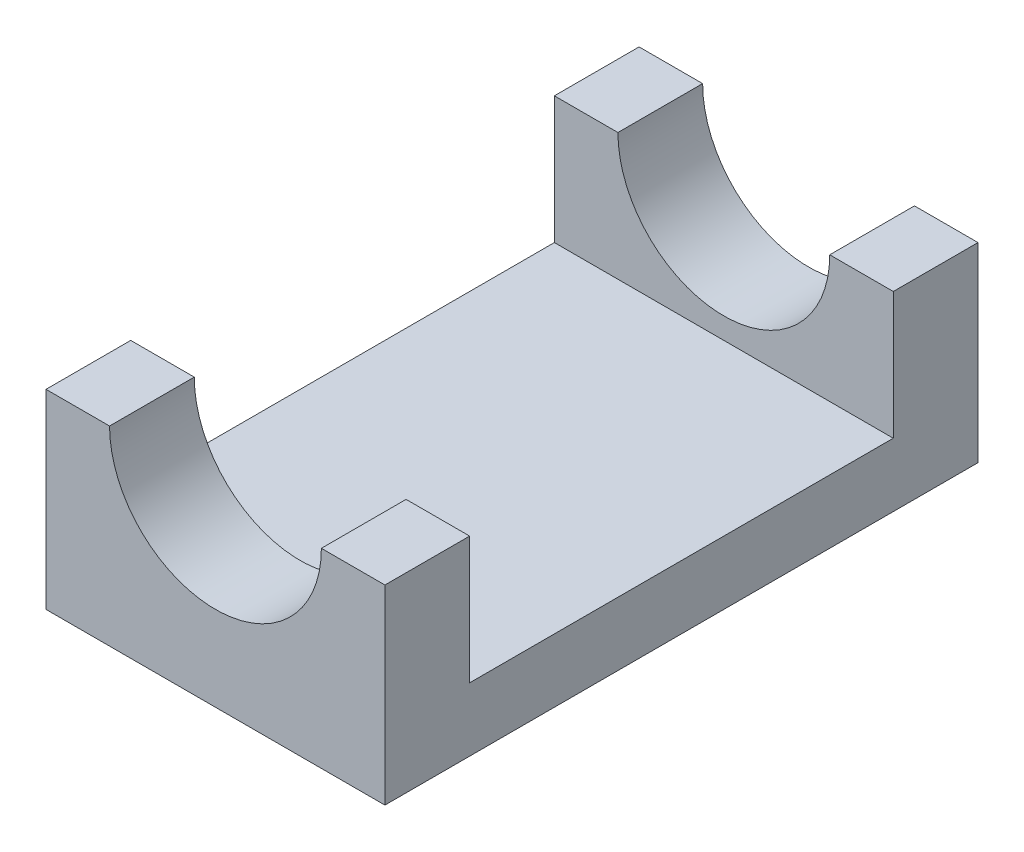
ISO-10303-21;
HEADER;
FILE_DESCRIPTION(('STEP AP214'),'2;1');
FILE_NAME('part.step','',(''),(''),'','','');
FILE_SCHEMA(('AUTOMOTIVE_DESIGN { 1 0 10303 214 1 1 1 1 }'));
ENDSEC;
DATA;
#1=APPLICATION_CONTEXT('core data for automotive mechanical design processes');
#2=APPLICATION_PROTOCOL_DEFINITION('international standard','automotive_design',2000,#1);
#3=PRODUCT_CONTEXT('',#1,'mechanical');
#4=PRODUCT('Part','Part','',(#3));
#5=PRODUCT_RELATED_PRODUCT_CATEGORY('part','',(#4));
#6=PRODUCT_DEFINITION_FORMATION('','',#4);
#7=PRODUCT_DEFINITION_CONTEXT('part definition',#1,'design');
#8=PRODUCT_DEFINITION('design','',#6,#7);
#9=PRODUCT_DEFINITION_SHAPE('','',#8);
#10=(LENGTH_UNIT() NAMED_UNIT(*) SI_UNIT(.MILLI.,.METRE.));
#11=(NAMED_UNIT(*) PLANE_ANGLE_UNIT() SI_UNIT($,.RADIAN.));
#12=(NAMED_UNIT(*) SI_UNIT($,.STERADIAN.) SOLID_ANGLE_UNIT());
#13=UNCERTAINTY_MEASURE_WITH_UNIT(LENGTH_MEASURE(1.E-05),#10,'distance_accuracy_value','');
#14=(GEOMETRIC_REPRESENTATION_CONTEXT(3) GLOBAL_UNCERTAINTY_ASSIGNED_CONTEXT((#13)) GLOBAL_UNIT_ASSIGNED_CONTEXT((#10,
#11,#12)) REPRESENTATION_CONTEXT('',''));
#15=CARTESIAN_POINT('',(0.,0.,0.));
#16=DIRECTION('',(0.,0.,1.));
#17=DIRECTION('',(1.,0.,0.));
#18=AXIS2_PLACEMENT_3D('',#15,#16,#17);
#19=CARTESIAN_POINT('',(-20.,0.,0.));
#20=DIRECTION('',(0.,-1.,0.));
#21=DIRECTION('',(1.,0.,0.));
#22=AXIS2_PLACEMENT_3D('',#19,#20,#21);
#23=PLANE('',#22);
#24=DIRECTION('',(0.,0.,1.));
#25=VECTOR('',#24,1.);
#26=CARTESIAN_POINT('',(-20.,0.,0.));
#27=LINE('',#26,#25);
#28=CARTESIAN_POINT('',(-20.,0.,0.));
#29=VERTEX_POINT('',#28);
#30=CARTESIAN_POINT('',(-20.,0.,10.));
#31=VERTEX_POINT('',#30);
#32=EDGE_CURVE('E172',#29,#31,#27,.T.);
#33=ORIENTED_EDGE('',*,*,#32,.T.);
#34=DIRECTION('',(1.,0.,0.));
#35=VECTOR('',#34,1.);
#36=CARTESIAN_POINT('',(-20.,0.,10.));
#37=LINE('',#36,#35);
#38=CARTESIAN_POINT('',(-12.5,0.,10.));
#39=VERTEX_POINT('',#38);
#40=EDGE_CURVE('E11',#31,#39,#37,.T.);
#41=ORIENTED_EDGE('',*,*,#40,.T.);
#42=DIRECTION('',(0.,0.,-1.));
#43=VECTOR('',#42,1.);
#44=CARTESIAN_POINT('',(-12.5,0.,10.));
#45=LINE('',#44,#43);
#46=CARTESIAN_POINT('',(-12.5,0.,0.));
#47=VERTEX_POINT('',#46);
#48=EDGE_CURVE('E145',#47,#39,#45,.F.);
#49=ORIENTED_EDGE('',*,*,#48,.F.);
#50=DIRECTION('',(1.,0.,0.));
#51=VECTOR('',#50,1.);
#52=CARTESIAN_POINT('',(-20.,0.,0.));
#53=LINE('',#52,#51);
#54=EDGE_CURVE('E176',#29,#47,#53,.T.);
#55=ORIENTED_EDGE('',*,*,#54,.F.);
#56=EDGE_LOOP('',(#33,#41,#49,#55));
#57=FACE_BOUND('',#56,.T.);
#58=ADVANCED_FACE('F42',(#57),#23,.F.);
#59=DIRECTION('',(0.,0.,-1.));
#60=VECTOR('',#59,1.);
#61=CARTESIAN_POINT('',(12.5,0.,10.));
#62=LINE('',#61,#60);
#63=CARTESIAN_POINT('',(12.5,0.,10.));
#64=VERTEX_POINT('',#63);
#65=CARTESIAN_POINT('',(12.5,0.,0.));
#66=VERTEX_POINT('',#65);
#67=EDGE_CURVE('E141',#64,#66,#62,.T.);
#68=ORIENTED_EDGE('',*,*,#67,.F.);
#69=DIRECTION('',(-1.,0.,0.));
#70=VECTOR('',#69,1.);
#71=CARTESIAN_POINT('',(-20.,0.,10.));
#72=LINE('',#71,#70);
#73=CARTESIAN_POINT('',(20.,0.,10.));
#74=VERTEX_POINT('',#73);
#75=EDGE_CURVE('E208',#74,#64,#72,.T.);
#76=ORIENTED_EDGE('',*,*,#75,.F.);
#77=DIRECTION('',(0.,0.,1.));
#78=VECTOR('',#77,1.);
#79=CARTESIAN_POINT('',(20.,0.,0.));
#80=LINE('',#79,#78);
#81=CARTESIAN_POINT('',(20.,0.,0.));
#82=VERTEX_POINT('',#81);
#83=EDGE_CURVE('E147',#82,#74,#80,.T.);
#84=ORIENTED_EDGE('',*,*,#83,.F.);
#85=EDGE_CURVE('E103',#66,#82,#53,.T.);
#86=ORIENTED_EDGE('',*,*,#85,.F.);
#87=EDGE_LOOP('',(#68,#76,#84,#86));
#88=FACE_BOUND('',#87,.T.);
#89=ADVANCED_FACE('F195',(#88),#23,.F.);
#90=CARTESIAN_POINT('',(20.,0.,60.));
#91=VERTEX_POINT('',#90);
#92=CARTESIAN_POINT('',(20.,0.,70.));
#93=VERTEX_POINT('',#92);
#94=EDGE_CURVE('E126',#91,#93,#80,.T.);
#95=ORIENTED_EDGE('',*,*,#94,.F.);
#96=DIRECTION('',(-1.,0.,0.));
#97=VECTOR('',#96,1.);
#98=CARTESIAN_POINT('',(-20.,0.,60.));
#99=LINE('',#98,#97);
#100=CARTESIAN_POINT('',(12.5,0.,60.));
#101=VERTEX_POINT('',#100);
#102=EDGE_CURVE('E50',#91,#101,#99,.T.);
#103=ORIENTED_EDGE('',*,*,#102,.T.);
#104=DIRECTION('',(0.,0.,1.));
#105=VECTOR('',#104,1.);
#106=CARTESIAN_POINT('',(12.5,0.,60.));
#107=LINE('',#106,#105);
#108=CARTESIAN_POINT('',(12.5,0.,70.));
#109=VERTEX_POINT('',#108);
#110=EDGE_CURVE('E123',#109,#101,#107,.F.);
#111=ORIENTED_EDGE('',*,*,#110,.F.);
#112=DIRECTION('',(1.,0.,0.));
#113=VECTOR('',#112,1.);
#114=CARTESIAN_POINT('',(-20.,0.,70.));
#115=LINE('',#114,#113);
#116=EDGE_CURVE('E215',#109,#93,#115,.T.);
#117=ORIENTED_EDGE('',*,*,#116,.T.);
#118=EDGE_LOOP('',(#95,#103,#111,#117));
#119=FACE_BOUND('',#118,.T.);
#120=ADVANCED_FACE('F120',(#119),#23,.F.);
#121=CARTESIAN_POINT('',(20.,22.5,70.));
#122=DIRECTION('',(-1.,0.,0.));
#123=DIRECTION('',(0.,-1.,0.));
#124=AXIS2_PLACEMENT_3D('',#121,#122,#123);
#125=PLANE('',#124);
#126=ORIENTED_EDGE('',*,*,#83,.T.);
#127=DIRECTION('',(0.,1.,0.));
#128=VECTOR('',#127,1.);
#129=CARTESIAN_POINT('',(20.,-15.,10.));
#130=LINE('',#129,#128);
#131=CARTESIAN_POINT('',(20.,-15.,10.));
#132=VERTEX_POINT('',#131);
#133=EDGE_CURVE('E221',#132,#74,#130,.T.);
#134=ORIENTED_EDGE('',*,*,#133,.F.);
#135=DIRECTION('',(0.,0.,-1.));
#136=VECTOR('',#135,1.);
#137=CARTESIAN_POINT('',(20.,-15.,10.));
#138=LINE('',#137,#136);
#139=CARTESIAN_POINT('',(20.,-15.,60.));
#140=VERTEX_POINT('',#139);
#141=EDGE_CURVE('E231',#140,#132,#138,.T.);
#142=ORIENTED_EDGE('',*,*,#141,.F.);
#143=DIRECTION('',(0.,1.,0.));
#144=VECTOR('',#143,1.);
#145=CARTESIAN_POINT('',(20.,-15.,60.));
#146=LINE('',#145,#144);
#147=EDGE_CURVE('E218',#140,#91,#146,.T.);
#148=ORIENTED_EDGE('',*,*,#147,.T.);
#149=ORIENTED_EDGE('',*,*,#94,.T.);
#150=DIRECTION('',(0.,1.,0.));
#151=VECTOR('',#150,1.);
#152=CARTESIAN_POINT('',(20.,22.5,70.));
#153=LINE('',#152,#151);
#154=CARTESIAN_POINT('',(20.,-22.5,70.));
#155=VERTEX_POINT('',#154);
#156=EDGE_CURVE('E89',#155,#93,#153,.T.);
#157=ORIENTED_EDGE('',*,*,#156,.F.);
#158=DIRECTION('',(0.,0.,-1.));
#159=VECTOR('',#158,1.);
#160=CARTESIAN_POINT('',(20.,-22.5,70.));
#161=LINE('',#160,#159);
#162=CARTESIAN_POINT('',(20.,-22.5,0.));
#163=VERTEX_POINT('',#162);
#164=EDGE_CURVE('E82',#155,#163,#161,.T.);
#165=ORIENTED_EDGE('',*,*,#164,.T.);
#166=DIRECTION('',(0.,1.,0.));
#167=VECTOR('',#166,1.);
#168=CARTESIAN_POINT('',(20.,22.5,0.));
#169=LINE('',#168,#167);
#170=EDGE_CURVE('E96',#163,#82,#169,.T.);
#171=ORIENTED_EDGE('',*,*,#170,.T.);
#172=EDGE_LOOP('',(#126,#134,#142,#148,#149,#157,#165,#171));
#173=FACE_BOUND('',#172,.T.);
#174=ADVANCED_FACE('F44',(#173),#125,.F.);
#175=CARTESIAN_POINT('',(-20.,22.5,70.));
#176=DIRECTION('',(1.,0.,0.));
#177=DIRECTION('',(0.,1.,0.));
#178=AXIS2_PLACEMENT_3D('',#175,#176,#177);
#179=PLANE('',#178);
#180=DIRECTION('',(0.,0.,1.));
#181=VECTOR('',#180,1.);
#182=CARTESIAN_POINT('',(-20.,-15.,10.));
#183=LINE('',#182,#181);
#184=CARTESIAN_POINT('',(-20.,-15.,10.));
#185=VERTEX_POINT('',#184);
#186=CARTESIAN_POINT('',(-20.,-15.,60.));
#187=VERTEX_POINT('',#186);
#188=EDGE_CURVE('E226',#185,#187,#183,.T.);
#189=ORIENTED_EDGE('',*,*,#188,.F.);
#190=DIRECTION('',(0.,1.,0.));
#191=VECTOR('',#190,1.);
#192=CARTESIAN_POINT('',(-20.,-15.,10.));
#193=LINE('',#192,#191);
#194=EDGE_CURVE('E223',#185,#31,#193,.T.);
#195=ORIENTED_EDGE('',*,*,#194,.T.);
#196=ORIENTED_EDGE('',*,*,#32,.F.);
#197=DIRECTION('',(0.,-1.,0.));
#198=VECTOR('',#197,1.);
#199=CARTESIAN_POINT('',(-20.,22.5,0.));
#200=LINE('',#199,#198);
#201=CARTESIAN_POINT('',(-20.,-22.5,0.));
#202=VERTEX_POINT('',#201);
#203=EDGE_CURVE('E90',#29,#202,#200,.T.);
#204=ORIENTED_EDGE('',*,*,#203,.T.);
#205=DIRECTION('',(0.,0.,-1.));
#206=VECTOR('',#205,1.);
#207=CARTESIAN_POINT('',(-20.,-22.5,70.));
#208=LINE('',#207,#206);
#209=CARTESIAN_POINT('',(-20.,-22.5,70.));
#210=VERTEX_POINT('',#209);
#211=EDGE_CURVE('E85',#210,#202,#208,.T.);
#212=ORIENTED_EDGE('',*,*,#211,.F.);
#213=DIRECTION('',(0.,-1.,0.));
#214=VECTOR('',#213,1.);
#215=CARTESIAN_POINT('',(-20.,22.5,70.));
#216=LINE('',#215,#214);
#217=CARTESIAN_POINT('',(-20.,0.,70.));
#218=VERTEX_POINT('',#217);
#219=EDGE_CURVE('E157',#218,#210,#216,.T.);
#220=ORIENTED_EDGE('',*,*,#219,.F.);
#221=CARTESIAN_POINT('',(-20.,0.,60.));
#222=VERTEX_POINT('',#221);
#223=EDGE_CURVE('E212',#222,#218,#27,.T.);
#224=ORIENTED_EDGE('',*,*,#223,.F.);
#225=DIRECTION('',(0.,1.,0.));
#226=VECTOR('',#225,1.);
#227=CARTESIAN_POINT('',(-20.,-15.,60.));
#228=LINE('',#227,#226);
#229=EDGE_CURVE('E57',#187,#222,#228,.T.);
#230=ORIENTED_EDGE('',*,*,#229,.F.);
#231=EDGE_LOOP('',(#189,#195,#196,#204,#212,#220,#224,#230));
#232=FACE_BOUND('',#231,.T.);
#233=ADVANCED_FACE('F167',(#232),#179,.F.);
#234=CARTESIAN_POINT('',(-20.,-22.5,70.));
#235=DIRECTION('',(0.,1.,0.));
#236=DIRECTION('',(0.,0.,1.));
#237=AXIS2_PLACEMENT_3D('',#234,#235,#236);
#238=PLANE('',#237);
#239=DIRECTION('',(1.,0.,0.));
#240=VECTOR('',#239,1.);
#241=CARTESIAN_POINT('',(-20.,-22.5,0.));
#242=LINE('',#241,#240);
#243=EDGE_CURVE('E79',#202,#163,#242,.T.);
#244=ORIENTED_EDGE('',*,*,#243,.T.);
#245=ORIENTED_EDGE('',*,*,#164,.F.);
#246=DIRECTION('',(1.,0.,0.));
#247=VECTOR('',#246,1.);
#248=CARTESIAN_POINT('',(-20.,-22.5,70.));
#249=LINE('',#248,#247);
#250=EDGE_CURVE('E66',#210,#155,#249,.T.);
#251=ORIENTED_EDGE('',*,*,#250,.F.);
#252=ORIENTED_EDGE('',*,*,#211,.T.);
#253=EDGE_LOOP('',(#244,#245,#251,#252));
#254=FACE_BOUND('',#253,.T.);
#255=ADVANCED_FACE('F81',(#254),#238,.F.);
#256=CARTESIAN_POINT('',(0.,0.,70.));
#257=DIRECTION('',(0.,0.,1.));
#258=DIRECTION('',(1.,0.,0.));
#259=AXIS2_PLACEMENT_3D('',#256,#257,#258);
#260=PLANE('',#259);
#261=CARTESIAN_POINT('',(-12.5,0.,70.));
#262=VERTEX_POINT('',#261);
#263=EDGE_CURVE('E163',#218,#262,#115,.T.);
#264=ORIENTED_EDGE('',*,*,#263,.F.);
#265=ORIENTED_EDGE('',*,*,#219,.T.);
#266=ORIENTED_EDGE('',*,*,#250,.T.);
#267=ORIENTED_EDGE('',*,*,#156,.T.);
#268=ORIENTED_EDGE('',*,*,#116,.F.);
#269=CARTESIAN_POINT('',(0.,0.,70.));
#270=DIRECTION('',(0.,0.,1.));
#271=DIRECTION('',(1.,0.,0.));
#272=AXIS2_PLACEMENT_3D('',#269,#270,#271);
#273=CIRCLE('',#272,12.5);
#274=EDGE_CURVE('E140',#262,#109,#273,.T.);
#275=ORIENTED_EDGE('',*,*,#274,.F.);
#276=EDGE_LOOP('',(#264,#265,#266,#267,#268,#275));
#277=FACE_BOUND('',#276,.T.);
#278=ADVANCED_FACE('F160',(#277),#260,.T.);
#279=CARTESIAN_POINT('',(0.,0.,0.));
#280=DIRECTION('',(0.,0.,1.));
#281=DIRECTION('',(1.,0.,0.));
#282=AXIS2_PLACEMENT_3D('',#279,#280,#281);
#283=PLANE('',#282);
#284=ORIENTED_EDGE('',*,*,#203,.F.);
#285=ORIENTED_EDGE('',*,*,#54,.T.);
#286=CARTESIAN_POINT('',(0.,0.,0.));
#287=DIRECTION('',(0.,0.,-1.));
#288=DIRECTION('',(-1.,0.,0.));
#289=AXIS2_PLACEMENT_3D('',#286,#287,#288);
#290=CIRCLE('',#289,12.5);
#291=EDGE_CURVE('E108',#66,#47,#290,.T.);
#292=ORIENTED_EDGE('',*,*,#291,.F.);
#293=ORIENTED_EDGE('',*,*,#85,.T.);
#294=ORIENTED_EDGE('',*,*,#170,.F.);
#295=ORIENTED_EDGE('',*,*,#243,.F.);
#296=EDGE_LOOP('',(#284,#285,#292,#293,#294,#295));
#297=FACE_BOUND('',#296,.T.);
#298=ADVANCED_FACE('F100',(#297),#283,.F.);
#299=CARTESIAN_POINT('',(0.,0.,10.));
#300=DIRECTION('',(0.,0.,-1.));
#301=DIRECTION('',(-1.,0.,0.));
#302=AXIS2_PLACEMENT_3D('',#299,#300,#301);
#303=CYLINDRICAL_SURFACE('',#302,12.5);
#304=ORIENTED_EDGE('',*,*,#291,.T.);
#305=ORIENTED_EDGE('',*,*,#48,.T.);
#306=CARTESIAN_POINT('',(0.,0.,10.));
#307=DIRECTION('',(0.,0.,-1.));
#308=DIRECTION('',(-1.,0.,0.));
#309=AXIS2_PLACEMENT_3D('',#306,#307,#308);
#310=CIRCLE('',#309,12.5);
#311=EDGE_CURVE('E104',#64,#39,#310,.T.);
#312=ORIENTED_EDGE('',*,*,#311,.F.);
#313=ORIENTED_EDGE('',*,*,#67,.T.);
#314=EDGE_LOOP('',(#304,#305,#312,#313));
#315=FACE_BOUND('',#314,.T.);
#316=ADVANCED_FACE('F200',(#315),#303,.F.);
#317=CARTESIAN_POINT('',(0.,0.,60.));
#318=DIRECTION('',(0.,0.,1.));
#319=DIRECTION('',(1.,0.,0.));
#320=AXIS2_PLACEMENT_3D('',#317,#318,#319);
#321=CYLINDRICAL_SURFACE('',#320,12.5);
#322=ORIENTED_EDGE('',*,*,#274,.T.);
#323=ORIENTED_EDGE('',*,*,#110,.T.);
#324=CARTESIAN_POINT('',(0.,0.,60.));
#325=DIRECTION('',(0.,0.,1.));
#326=DIRECTION('',(1.,0.,0.));
#327=AXIS2_PLACEMENT_3D('',#324,#325,#326);
#328=CIRCLE('',#327,12.5);
#329=CARTESIAN_POINT('',(-12.5,0.,60.));
#330=VERTEX_POINT('',#329);
#331=EDGE_CURVE('E138',#330,#101,#328,.T.);
#332=ORIENTED_EDGE('',*,*,#331,.F.);
#333=DIRECTION('',(0.,0.,1.));
#334=VECTOR('',#333,1.);
#335=CARTESIAN_POINT('',(-12.5,0.,60.));
#336=LINE('',#335,#334);
#337=EDGE_CURVE('E142',#330,#262,#336,.T.);
#338=ORIENTED_EDGE('',*,*,#337,.T.);
#339=EDGE_LOOP('',(#322,#323,#332,#338));
#340=FACE_BOUND('',#339,.T.);
#341=ADVANCED_FACE('F136',(#340),#321,.F.);
#342=ORIENTED_EDGE('',*,*,#337,.F.);
#343=DIRECTION('',(1.,0.,0.));
#344=VECTOR('',#343,1.);
#345=CARTESIAN_POINT('',(-20.,0.,60.));
#346=LINE('',#345,#344);
#347=EDGE_CURVE('E227',#222,#330,#346,.T.);
#348=ORIENTED_EDGE('',*,*,#347,.F.);
#349=ORIENTED_EDGE('',*,*,#223,.T.);
#350=ORIENTED_EDGE('',*,*,#263,.T.);
#351=EDGE_LOOP('',(#342,#348,#349,#350));
#352=FACE_BOUND('',#351,.T.);
#353=ADVANCED_FACE('F247',(#352),#23,.F.);
#354=CARTESIAN_POINT('',(-20.,-15.,10.));
#355=DIRECTION('',(0.,0.,-1.));
#356=DIRECTION('',(-1.,0.,0.));
#357=AXIS2_PLACEMENT_3D('',#354,#355,#356);
#358=PLANE('',#357);
#359=ORIENTED_EDGE('',*,*,#40,.F.);
#360=ORIENTED_EDGE('',*,*,#194,.F.);
#361=DIRECTION('',(-1.,0.,0.));
#362=VECTOR('',#361,1.);
#363=CARTESIAN_POINT('',(-20.,-15.,10.));
#364=LINE('',#363,#362);
#365=EDGE_CURVE('E219',#132,#185,#364,.T.);
#366=ORIENTED_EDGE('',*,*,#365,.F.);
#367=ORIENTED_EDGE('',*,*,#133,.T.);
#368=ORIENTED_EDGE('',*,*,#75,.T.);
#369=ORIENTED_EDGE('',*,*,#311,.T.);
#370=EDGE_LOOP('',(#359,#360,#366,#367,#368,#369));
#371=FACE_BOUND('',#370,.T.);
#372=ADVANCED_FACE('F204',(#371),#358,.F.);
#373=CARTESIAN_POINT('',(-20.,-15.,60.));
#374=DIRECTION('',(0.,0.,1.));
#375=DIRECTION('',(1.,0.,0.));
#376=AXIS2_PLACEMENT_3D('',#373,#374,#375);
#377=PLANE('',#376);
#378=ORIENTED_EDGE('',*,*,#102,.F.);
#379=ORIENTED_EDGE('',*,*,#147,.F.);
#380=DIRECTION('',(1.,0.,0.));
#381=VECTOR('',#380,1.);
#382=CARTESIAN_POINT('',(-20.,-15.,60.));
#383=LINE('',#382,#381);
#384=EDGE_CURVE('E234',#187,#140,#383,.T.);
#385=ORIENTED_EDGE('',*,*,#384,.F.);
#386=ORIENTED_EDGE('',*,*,#229,.T.);
#387=ORIENTED_EDGE('',*,*,#347,.T.);
#388=ORIENTED_EDGE('',*,*,#331,.T.);
#389=EDGE_LOOP('',(#378,#379,#385,#386,#387,#388));
#390=FACE_BOUND('',#389,.T.);
#391=ADVANCED_FACE('F248',(#390),#377,.F.);
#392=CARTESIAN_POINT('',(0.,-15.,0.));
#393=DIRECTION('',(0.,1.,0.));
#394=DIRECTION('',(-1.,0.,0.));
#395=AXIS2_PLACEMENT_3D('',#392,#393,#394);
#396=PLANE('',#395);
#397=ORIENTED_EDGE('',*,*,#188,.T.);
#398=ORIENTED_EDGE('',*,*,#384,.T.);
#399=ORIENTED_EDGE('',*,*,#141,.T.);
#400=ORIENTED_EDGE('',*,*,#365,.T.);
#401=EDGE_LOOP('',(#397,#398,#399,#400));
#402=FACE_BOUND('',#401,.T.);
#403=ADVANCED_FACE('F239',(#402),#396,.T.);
#404=CLOSED_SHELL('',(#58,#89,#120,#174,#233,#255,#278,#298,#316,#341,#353,#372,#391,#403));
#405=MANIFOLD_SOLID_BREP('B2',#404);
#406=ADVANCED_BREP_SHAPE_REPRESENTATION('',(#18,#405),#14);
#407=SHAPE_DEFINITION_REPRESENTATION(#9,#406);
ENDSEC;
END-ISO-10303-21;
